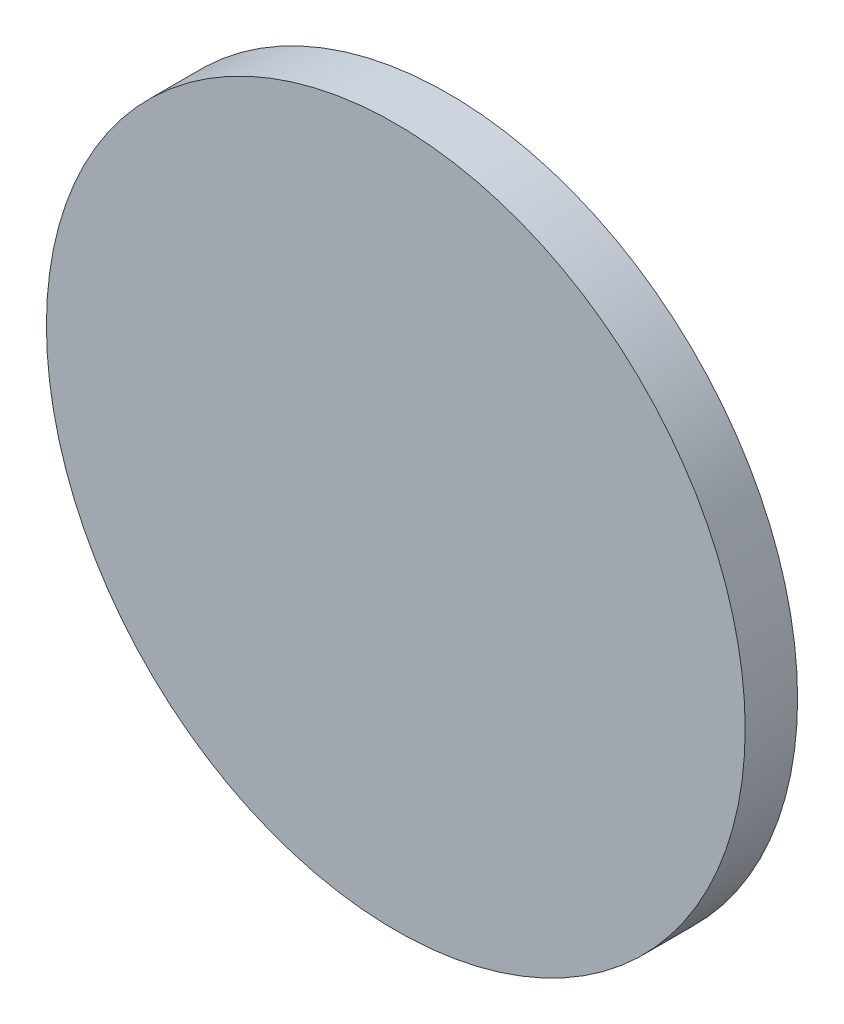
ISO-10303-21;
HEADER;
FILE_DESCRIPTION(('STEP AP214'),'2;1');
FILE_NAME('part.step','',(''),(''),'','','');
FILE_SCHEMA(('AUTOMOTIVE_DESIGN { 1 0 10303 214 1 1 1 1 }'));
ENDSEC;
DATA;
#1=APPLICATION_CONTEXT('core data for automotive mechanical design processes');
#2=APPLICATION_PROTOCOL_DEFINITION('international standard','automotive_design',2000,#1);
#3=PRODUCT_CONTEXT('',#1,'mechanical');
#4=PRODUCT('Part','Part','',(#3));
#5=PRODUCT_RELATED_PRODUCT_CATEGORY('part','',(#4));
#6=PRODUCT_DEFINITION_FORMATION('','',#4);
#7=PRODUCT_DEFINITION_CONTEXT('part definition',#1,'design');
#8=PRODUCT_DEFINITION('design','',#6,#7);
#9=PRODUCT_DEFINITION_SHAPE('','',#8);
#10=(LENGTH_UNIT() NAMED_UNIT(*) SI_UNIT(.MILLI.,.METRE.));
#11=(NAMED_UNIT(*) PLANE_ANGLE_UNIT() SI_UNIT($,.RADIAN.));
#12=(NAMED_UNIT(*) SI_UNIT($,.STERADIAN.) SOLID_ANGLE_UNIT());
#13=UNCERTAINTY_MEASURE_WITH_UNIT(LENGTH_MEASURE(1.E-05),#10,'distance_accuracy_value','');
#14=(GEOMETRIC_REPRESENTATION_CONTEXT(3) GLOBAL_UNCERTAINTY_ASSIGNED_CONTEXT((#13)) GLOBAL_UNIT_ASSIGNED_CONTEXT((#10,
#11,#12)) REPRESENTATION_CONTEXT('',''));
#15=CARTESIAN_POINT('',(0.,0.,0.));
#16=DIRECTION('',(0.,0.,1.));
#17=DIRECTION('',(1.,0.,0.));
#18=AXIS2_PLACEMENT_3D('',#15,#16,#17);
#19=CARTESIAN_POINT('',(4.15748,16.03491,0.76487));
#20=DIRECTION('',(0.,0.,-1.));
#21=DIRECTION('',(-1.,0.,0.));
#22=AXIS2_PLACEMENT_3D('',#19,#20,#21);
#23=PLANE('',#22);
#24=CARTESIAN_POINT('',(4.15748,16.03491,0.76487));
#25=DIRECTION('',(0.,0.,1.));
#26=DIRECTION('',(1.,0.,0.));
#27=AXIS2_PLACEMENT_3D('',#24,#25,#26);
#28=CIRCLE('',#27,0.2286);
#29=CARTESIAN_POINT('',(4.38608,16.03491,0.76487));
#30=VERTEX_POINT('',#29);
#31=EDGE_CURVE('E18',#30,#30,#28,.T.);
#32=ORIENTED_EDGE('',*,*,#31,.F.);
#33=EDGE_LOOP('',(#32));
#34=FACE_BOUND('',#33,.T.);
#35=ADVANCED_FACE('F15',(#34),#23,.T.);
#36=CARTESIAN_POINT('',(4.15748,16.03491,0.76487));
#37=DIRECTION('',(0.,0.,1.));
#38=DIRECTION('',(1.,0.,0.));
#39=AXIS2_PLACEMENT_3D('',#36,#37,#38);
#40=CYLINDRICAL_SURFACE('',#39,0.2286);
#41=CARTESIAN_POINT('',(4.15748,16.03491,0.79916));
#42=DIRECTION('',(0.,0.,1.));
#43=DIRECTION('',(1.,0.,0.));
#44=AXIS2_PLACEMENT_3D('',#41,#42,#43);
#45=CIRCLE('',#44,0.2286);
#46=CARTESIAN_POINT('',(4.38608,16.03491,0.79916));
#47=VERTEX_POINT('',#46);
#48=EDGE_CURVE('E10',#47,#47,#45,.T.);
#49=ORIENTED_EDGE('',*,*,#48,.F.);
#50=EDGE_LOOP('',(#49));
#51=FACE_BOUND('',#50,.T.);
#52=ORIENTED_EDGE('',*,*,#31,.T.);
#53=EDGE_LOOP('',(#52));
#54=FACE_BOUND('',#53,.T.);
#55=ADVANCED_FACE('F27',(#51,#54),#40,.T.);
#56=CARTESIAN_POINT('',(4.15748,16.03491,0.79916));
#57=DIRECTION('',(0.,0.,1.));
#58=DIRECTION('',(1.,0.,0.));
#59=AXIS2_PLACEMENT_3D('',#56,#57,#58);
#60=PLANE('',#59);
#61=ORIENTED_EDGE('',*,*,#48,.T.);
#62=EDGE_LOOP('',(#61));
#63=FACE_BOUND('',#62,.T.);
#64=ADVANCED_FACE('F34',(#63),#60,.T.);
#65=CLOSED_SHELL('',(#35,#55,#64));
#66=MANIFOLD_SOLID_BREP('B1',#65);
#67=ADVANCED_BREP_SHAPE_REPRESENTATION('',(#18,#66),#14);
#68=SHAPE_DEFINITION_REPRESENTATION(#9,#67);
ENDSEC;
END-ISO-10303-21;
